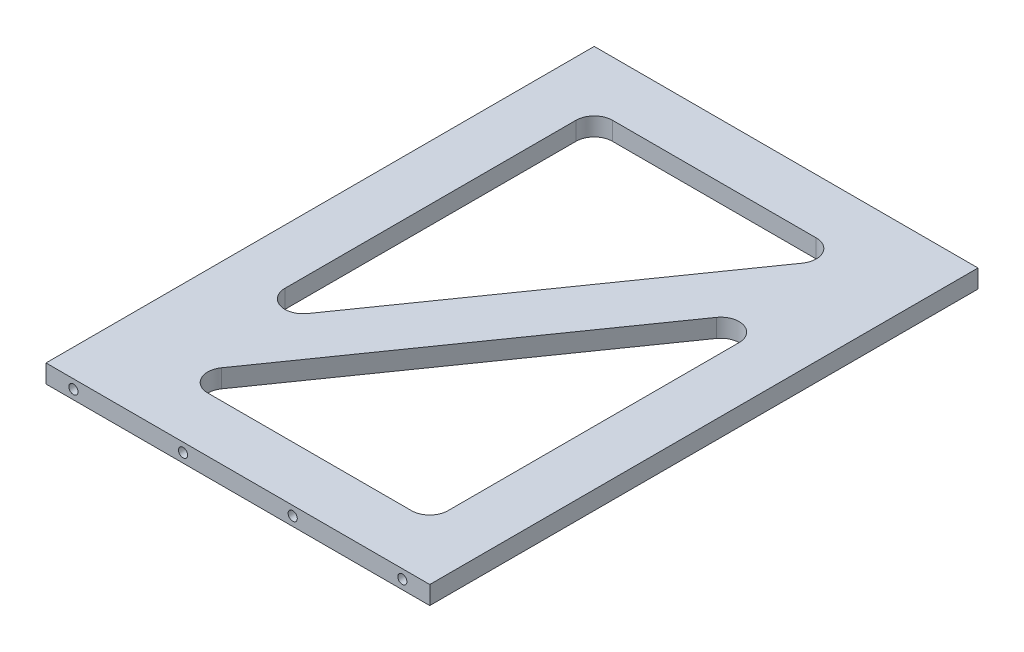
ISO-10303-21;
HEADER;
FILE_DESCRIPTION(('STEP AP214'),'2;1');
FILE_NAME('part.step','',(''),(''),'','','');
FILE_SCHEMA(('AUTOMOTIVE_DESIGN { 1 0 10303 214 1 1 1 1 }'));
ENDSEC;
DATA;
#1=APPLICATION_CONTEXT('core data for automotive mechanical design processes');
#2=APPLICATION_PROTOCOL_DEFINITION('international standard','automotive_design',2000,#1);
#3=PRODUCT_CONTEXT('',#1,'mechanical');
#4=PRODUCT('Part','Part','',(#3));
#5=PRODUCT_RELATED_PRODUCT_CATEGORY('part','',(#4));
#6=PRODUCT_DEFINITION_FORMATION('','',#4);
#7=PRODUCT_DEFINITION_CONTEXT('part definition',#1,'design');
#8=PRODUCT_DEFINITION('design','',#6,#7);
#9=PRODUCT_DEFINITION_SHAPE('','',#8);
#10=(LENGTH_UNIT() NAMED_UNIT(*) SI_UNIT(.MILLI.,.METRE.));
#11=(NAMED_UNIT(*) PLANE_ANGLE_UNIT() SI_UNIT($,.RADIAN.));
#12=(NAMED_UNIT(*) SI_UNIT($,.STERADIAN.) SOLID_ANGLE_UNIT());
#13=UNCERTAINTY_MEASURE_WITH_UNIT(LENGTH_MEASURE(1.E-05),#10,'distance_accuracy_value','');
#14=(GEOMETRIC_REPRESENTATION_CONTEXT(3) GLOBAL_UNCERTAINTY_ASSIGNED_CONTEXT((#13)) GLOBAL_UNIT_ASSIGNED_CONTEXT((#10,
#11,#12)) REPRESENTATION_CONTEXT('',''));
#15=CARTESIAN_POINT('',(0.,0.,0.));
#16=DIRECTION('',(0.,0.,1.));
#17=DIRECTION('',(1.,0.,0.));
#18=AXIS2_PLACEMENT_3D('',#15,#16,#17);
#19=CARTESIAN_POINT('',(0.,10.,0.));
#20=DIRECTION('',(1.,0.,0.));
#21=DIRECTION('',(0.,0.,-1.));
#22=AXIS2_PLACEMENT_3D('',#19,#20,#21);
#23=PLANE('',#22);
#24=DIRECTION('',(0.,0.,1.));
#25=VECTOR('',#24,1.);
#26=CARTESIAN_POINT('',(0.,0.,0.));
#27=LINE('',#26,#25);
#28=CARTESIAN_POINT('',(0.,0.,-300.));
#29=VERTEX_POINT('',#28);
#30=CARTESIAN_POINT('',(0.,0.,0.));
#31=VERTEX_POINT('',#30);
#32=EDGE_CURVE('E263',#29,#31,#27,.T.);
#33=ORIENTED_EDGE('',*,*,#32,.T.);
#34=DIRECTION('',(0.,-1.,0.));
#35=VECTOR('',#34,1.);
#36=CARTESIAN_POINT('',(0.,10.,0.));
#37=LINE('',#36,#35);
#38=CARTESIAN_POINT('',(0.,10.,0.));
#39=VERTEX_POINT('',#38);
#40=EDGE_CURVE('E296',#39,#31,#37,.T.);
#41=ORIENTED_EDGE('',*,*,#40,.F.);
#42=DIRECTION('',(0.,0.,1.));
#43=VECTOR('',#42,1.);
#44=CARTESIAN_POINT('',(0.,10.,0.));
#45=LINE('',#44,#43);
#46=CARTESIAN_POINT('',(0.,10.,-300.));
#47=VERTEX_POINT('',#46);
#48=EDGE_CURVE('E270',#47,#39,#45,.T.);
#49=ORIENTED_EDGE('',*,*,#48,.F.);
#50=DIRECTION('',(0.,-1.,0.));
#51=VECTOR('',#50,1.);
#52=CARTESIAN_POINT('',(0.,10.,-300.));
#53=LINE('',#52,#51);
#54=EDGE_CURVE('E280',#47,#29,#53,.T.);
#55=ORIENTED_EDGE('',*,*,#54,.T.);
#56=EDGE_LOOP('',(#33,#41,#49,#55));
#57=FACE_BOUND('',#56,.T.);
#58=ADVANCED_FACE('F44',(#57),#23,.F.);
#59=CARTESIAN_POINT('',(0.,10.,0.));
#60=DIRECTION('',(0.,0.,-1.));
#61=DIRECTION('',(-1.,0.,0.));
#62=AXIS2_PLACEMENT_3D('',#59,#60,#61);
#63=PLANE('',#62);
#64=CARTESIAN_POINT('',(15.,5.,0.));
#65=DIRECTION('',(0.,0.,1.));
#66=DIRECTION('',(1.,0.,0.));
#67=AXIS2_PLACEMENT_3D('',#64,#65,#66);
#68=CIRCLE('',#67,2.5);
#69=CARTESIAN_POINT('',(17.5,5.,0.));
#70=VERTEX_POINT('',#69);
#71=EDGE_CURVE('E212',#70,#70,#68,.T.);
#72=ORIENTED_EDGE('',*,*,#71,.F.);
#73=EDGE_LOOP('',(#72));
#74=FACE_BOUND('',#73,.T.);
#75=CARTESIAN_POINT('',(135.,5.,0.));
#76=DIRECTION('',(0.,0.,1.));
#77=DIRECTION('',(1.,0.,0.));
#78=AXIS2_PLACEMENT_3D('',#75,#76,#77);
#79=CIRCLE('',#78,2.5);
#80=CARTESIAN_POINT('',(137.5,5.,0.));
#81=VERTEX_POINT('',#80);
#82=EDGE_CURVE('E218',#81,#81,#79,.T.);
#83=ORIENTED_EDGE('',*,*,#82,.F.);
#84=EDGE_LOOP('',(#83));
#85=FACE_BOUND('',#84,.T.);
#86=CARTESIAN_POINT('',(195.,5.,0.));
#87=DIRECTION('',(0.,0.,1.));
#88=DIRECTION('',(1.,0.,0.));
#89=AXIS2_PLACEMENT_3D('',#86,#87,#88);
#90=CIRCLE('',#89,2.5);
#91=CARTESIAN_POINT('',(197.5,5.,0.));
#92=VERTEX_POINT('',#91);
#93=EDGE_CURVE('E224',#92,#92,#90,.T.);
#94=ORIENTED_EDGE('',*,*,#93,.F.);
#95=EDGE_LOOP('',(#94));
#96=FACE_BOUND('',#95,.T.);
#97=CARTESIAN_POINT('',(75.,5.,0.));
#98=DIRECTION('',(0.,0.,1.));
#99=DIRECTION('',(1.,0.,0.));
#100=AXIS2_PLACEMENT_3D('',#97,#98,#99);
#101=CIRCLE('',#100,2.5);
#102=CARTESIAN_POINT('',(77.5,5.,0.));
#103=VERTEX_POINT('',#102);
#104=EDGE_CURVE('E230',#103,#103,#101,.T.);
#105=ORIENTED_EDGE('',*,*,#104,.F.);
#106=EDGE_LOOP('',(#105));
#107=FACE_BOUND('',#106,.T.);
#108=DIRECTION('',(1.,0.,0.));
#109=VECTOR('',#108,1.);
#110=CARTESIAN_POINT('',(0.,0.,0.));
#111=LINE('',#110,#109);
#112=CARTESIAN_POINT('',(210.,0.,0.));
#113=VERTEX_POINT('',#112);
#114=EDGE_CURVE('E283',#31,#113,#111,.T.);
#115=ORIENTED_EDGE('',*,*,#114,.T.);
#116=DIRECTION('',(0.,-1.,0.));
#117=VECTOR('',#116,1.);
#118=CARTESIAN_POINT('',(210.,10.,0.));
#119=LINE('',#118,#117);
#120=CARTESIAN_POINT('',(210.,10.,0.));
#121=VERTEX_POINT('',#120);
#122=EDGE_CURVE('E293',#121,#113,#119,.T.);
#123=ORIENTED_EDGE('',*,*,#122,.F.);
#124=DIRECTION('',(1.,0.,0.));
#125=VECTOR('',#124,1.);
#126=CARTESIAN_POINT('',(0.,10.,0.));
#127=LINE('',#126,#125);
#128=EDGE_CURVE('E273',#39,#121,#127,.T.);
#129=ORIENTED_EDGE('',*,*,#128,.F.);
#130=ORIENTED_EDGE('',*,*,#40,.T.);
#131=EDGE_LOOP('',(#115,#123,#129,#130));
#132=FACE_BOUND('',#131,.T.);
#133=ADVANCED_FACE('F388',(#74,#85,#96,#107,#132),#63,.F.);
#134=CARTESIAN_POINT('',(210.,10.,0.));
#135=DIRECTION('',(-1.,0.,0.));
#136=DIRECTION('',(0.,0.,1.));
#137=AXIS2_PLACEMENT_3D('',#134,#135,#136);
#138=PLANE('',#137);
#139=DIRECTION('',(0.,0.,-1.));
#140=VECTOR('',#139,1.);
#141=CARTESIAN_POINT('',(210.,0.,0.));
#142=LINE('',#141,#140);
#143=CARTESIAN_POINT('',(210.,0.,-300.));
#144=VERTEX_POINT('',#143);
#145=EDGE_CURVE('E285',#113,#144,#142,.T.);
#146=ORIENTED_EDGE('',*,*,#145,.T.);
#147=DIRECTION('',(0.,-1.,0.));
#148=VECTOR('',#147,1.);
#149=CARTESIAN_POINT('',(210.,10.,-300.));
#150=LINE('',#149,#148);
#151=CARTESIAN_POINT('',(210.,10.,-300.));
#152=VERTEX_POINT('',#151);
#153=EDGE_CURVE('E290',#152,#144,#150,.T.);
#154=ORIENTED_EDGE('',*,*,#153,.F.);
#155=DIRECTION('',(0.,0.,-1.));
#156=VECTOR('',#155,1.);
#157=CARTESIAN_POINT('',(210.,10.,0.));
#158=LINE('',#157,#156);
#159=EDGE_CURVE('E276',#121,#152,#158,.T.);
#160=ORIENTED_EDGE('',*,*,#159,.F.);
#161=ORIENTED_EDGE('',*,*,#122,.T.);
#162=EDGE_LOOP('',(#146,#154,#160,#161));
#163=FACE_BOUND('',#162,.T.);
#164=ADVANCED_FACE('F395',(#163),#138,.F.);
#165=CARTESIAN_POINT('',(0.,10.,-300.));
#166=DIRECTION('',(0.,0.,1.));
#167=DIRECTION('',(1.,0.,0.));
#168=AXIS2_PLACEMENT_3D('',#165,#166,#167);
#169=PLANE('',#168);
#170=CARTESIAN_POINT('',(195.,5.,-300.));
#171=DIRECTION('',(0.,0.,-1.));
#172=DIRECTION('',(-1.,0.,0.));
#173=AXIS2_PLACEMENT_3D('',#170,#171,#172);
#174=CIRCLE('',#173,2.5);
#175=CARTESIAN_POINT('',(192.5,5.,-300.));
#176=VERTEX_POINT('',#175);
#177=EDGE_CURVE('E190',#176,#176,#174,.T.);
#178=ORIENTED_EDGE('',*,*,#177,.F.);
#179=EDGE_LOOP('',(#178));
#180=FACE_BOUND('',#179,.T.);
#181=CARTESIAN_POINT('',(15.,5.00000000000003,-300.));
#182=DIRECTION('',(0.,0.,-1.));
#183=DIRECTION('',(-1.,0.,0.));
#184=AXIS2_PLACEMENT_3D('',#181,#182,#183);
#185=CIRCLE('',#184,2.49999999999999);
#186=CARTESIAN_POINT('',(12.5,5.00000000000003,-300.));
#187=VERTEX_POINT('',#186);
#188=EDGE_CURVE('E189',#187,#187,#185,.T.);
#189=ORIENTED_EDGE('',*,*,#188,.F.);
#190=EDGE_LOOP('',(#189));
#191=FACE_BOUND('',#190,.T.);
#192=CARTESIAN_POINT('',(135.,5.,-300.));
#193=DIRECTION('',(0.,0.,-1.));
#194=DIRECTION('',(-1.,0.,0.));
#195=AXIS2_PLACEMENT_3D('',#192,#193,#194);
#196=CIRCLE('',#195,2.5);
#197=CARTESIAN_POINT('',(132.5,5.,-300.));
#198=VERTEX_POINT('',#197);
#199=EDGE_CURVE('E200',#198,#198,#196,.T.);
#200=ORIENTED_EDGE('',*,*,#199,.F.);
#201=EDGE_LOOP('',(#200));
#202=FACE_BOUND('',#201,.T.);
#203=CARTESIAN_POINT('',(75.,5.00000000000003,-300.));
#204=DIRECTION('',(0.,0.,-1.));
#205=DIRECTION('',(-1.,0.,0.));
#206=AXIS2_PLACEMENT_3D('',#203,#204,#205);
#207=CIRCLE('',#206,2.49999999999999);
#208=CARTESIAN_POINT('',(72.5,5.00000000000003,-300.));
#209=VERTEX_POINT('',#208);
#210=EDGE_CURVE('E206',#209,#209,#207,.T.);
#211=ORIENTED_EDGE('',*,*,#210,.F.);
#212=EDGE_LOOP('',(#211));
#213=FACE_BOUND('',#212,.T.);
#214=DIRECTION('',(-1.,0.,0.));
#215=VECTOR('',#214,1.);
#216=CARTESIAN_POINT('',(0.,0.,-300.));
#217=LINE('',#216,#215);
#218=EDGE_CURVE('E274',#144,#29,#217,.T.);
#219=ORIENTED_EDGE('',*,*,#218,.T.);
#220=ORIENTED_EDGE('',*,*,#54,.F.);
#221=DIRECTION('',(-1.,0.,0.));
#222=VECTOR('',#221,1.);
#223=CARTESIAN_POINT('',(0.,10.,-300.));
#224=LINE('',#223,#222);
#225=EDGE_CURVE('E278',#152,#47,#224,.T.);
#226=ORIENTED_EDGE('',*,*,#225,.F.);
#227=ORIENTED_EDGE('',*,*,#153,.T.);
#228=EDGE_LOOP('',(#219,#220,#226,#227));
#229=FACE_BOUND('',#228,.T.);
#230=ADVANCED_FACE('F401',(#180,#191,#202,#213,#229),#169,.F.);
#231=CARTESIAN_POINT('',(0.,10.,0.));
#232=DIRECTION('',(0.,-1.,0.));
#233=DIRECTION('',(0.,0.,-1.));
#234=AXIS2_PLACEMENT_3D('',#231,#232,#233);
#235=PLANE('',#234);
#236=DIRECTION('',(-1.,0.,0.));
#237=VECTOR('',#236,1.);
#238=CARTESIAN_POINT('',(30.,10.,-270.));
#239=LINE('',#238,#237);
#240=CARTESIAN_POINT('',(151.483610960666,10.,-270.));
#241=VERTEX_POINT('',#240);
#242=CARTESIAN_POINT('',(40.,10.,-270.));
#243=VERTEX_POINT('',#242);
#244=EDGE_CURVE('E250',#241,#243,#239,.T.);
#245=ORIENTED_EDGE('',*,*,#244,.F.);
#246=CARTESIAN_POINT('',(151.483610960666,10.,-260.));
#247=DIRECTION('',(0.,-1.,0.));
#248=DIRECTION('',(0.,0.,-1.));
#249=AXIS2_PLACEMENT_3D('',#246,#247,#248);
#250=CIRCLE('',#249,10.);
#251=CARTESIAN_POINT('',(159.675930165856,10.,-254.265376556367));
#252=VERTEX_POINT('',#251);
#253=EDGE_CURVE('E336',#241,#252,#250,.T.);
#254=ORIENTED_EDGE('',*,*,#253,.T.);
#255=DIRECTION('',(0.573462344363328,0.,-0.819231920519041));
#256=VECTOR('',#255,1.);
#257=CARTESIAN_POINT('',(170.690166576399,10.,-270.));
#258=LINE('',#257,#256);
#259=CARTESIAN_POINT('',(48.1923192051904,10.,-95.003075183987));
#260=VERTEX_POINT('',#259);
#261=EDGE_CURVE('E236',#260,#252,#258,.T.);
#262=ORIENTED_EDGE('',*,*,#261,.F.);
#263=CARTESIAN_POINT('',(40.,10.,-100.73769862762));
#264=DIRECTION('',(0.,-1.,0.));
#265=DIRECTION('',(0.,0.,-1.));
#266=AXIS2_PLACEMENT_3D('',#263,#264,#265);
#267=CIRCLE('',#266,10.);
#268=CARTESIAN_POINT('',(30.,10.,-100.73769862762));
#269=VERTEX_POINT('',#268);
#270=EDGE_CURVE('E344',#260,#269,#267,.T.);
#271=ORIENTED_EDGE('',*,*,#270,.T.);
#272=DIRECTION('',(0.,0.,1.));
#273=VECTOR('',#272,1.);
#274=CARTESIAN_POINT('',(30.,10.,-69.0140477480008));
#275=LINE('',#274,#273);
#276=CARTESIAN_POINT('',(30.,10.,-260.));
#277=VERTEX_POINT('',#276);
#278=EDGE_CURVE('E241',#277,#269,#275,.T.);
#279=ORIENTED_EDGE('',*,*,#278,.F.);
#280=CARTESIAN_POINT('',(40.,10.,-260.));
#281=DIRECTION('',(0.,-1.,0.));
#282=DIRECTION('',(0.,0.,-1.));
#283=AXIS2_PLACEMENT_3D('',#280,#281,#282);
#284=CIRCLE('',#283,10.);
#285=EDGE_CURVE('E328',#277,#243,#284,.T.);
#286=ORIENTED_EDGE('',*,*,#285,.T.);
#287=EDGE_LOOP('',(#245,#254,#262,#271,#279,#286));
#288=FACE_BOUND('',#287,.T.);
#289=DIRECTION('',(1.,0.,0.));
#290=VECTOR('',#289,1.);
#291=CARTESIAN_POINT('',(39.3098334236006,10.,-30.));
#292=LINE('',#291,#290);
#293=CARTESIAN_POINT('',(58.5163890393343,10.,-30.));
#294=VERTEX_POINT('',#293);
#295=CARTESIAN_POINT('',(170.,10.,-30.));
#296=VERTEX_POINT('',#295);
#297=EDGE_CURVE('E266',#294,#296,#292,.T.);
#298=ORIENTED_EDGE('',*,*,#297,.F.);
#299=CARTESIAN_POINT('',(58.5163890393343,10.,-40.));
#300=DIRECTION('',(0.,-1.,0.));
#301=DIRECTION('',(0.,0.,-1.));
#302=AXIS2_PLACEMENT_3D('',#299,#300,#301);
#303=CIRCLE('',#302,10.);
#304=CARTESIAN_POINT('',(50.3240698341439,10.,-45.7346234436333));
#305=VERTEX_POINT('',#304);
#306=EDGE_CURVE('E52',#294,#305,#303,.T.);
#307=ORIENTED_EDGE('',*,*,#306,.T.);
#308=DIRECTION('',(-0.573462344363328,0.,0.81923192051904));
#309=VECTOR('',#308,1.);
#310=CARTESIAN_POINT('',(180.,10.,-230.985952251999));
#311=LINE('',#310,#309);
#312=CARTESIAN_POINT('',(161.80768079481,10.,-204.996924816013));
#313=VERTEX_POINT('',#312);
#314=EDGE_CURVE('E247',#313,#305,#311,.T.);
#315=ORIENTED_EDGE('',*,*,#314,.F.);
#316=CARTESIAN_POINT('',(170.,10.,-199.26230137238));
#317=DIRECTION('',(0.,-1.,0.));
#318=DIRECTION('',(0.,0.,-1.));
#319=AXIS2_PLACEMENT_3D('',#316,#317,#318);
#320=CIRCLE('',#319,10.);
#321=CARTESIAN_POINT('',(180.,10.,-199.26230137238));
#322=VERTEX_POINT('',#321);
#323=EDGE_CURVE('E332',#313,#322,#320,.T.);
#324=ORIENTED_EDGE('',*,*,#323,.T.);
#325=DIRECTION('',(0.,0.,-1.));
#326=VECTOR('',#325,1.);
#327=CARTESIAN_POINT('',(180.,10.,-30.));
#328=LINE('',#327,#326);
#329=CARTESIAN_POINT('',(180.,10.,-40.));
#330=VERTEX_POINT('',#329);
#331=EDGE_CURVE('E258',#330,#322,#328,.T.);
#332=ORIENTED_EDGE('',*,*,#331,.F.);
#333=CARTESIAN_POINT('',(170.,10.,-40.));
#334=DIRECTION('',(0.,-1.,0.));
#335=DIRECTION('',(0.,0.,-1.));
#336=AXIS2_PLACEMENT_3D('',#333,#334,#335);
#337=CIRCLE('',#336,10.);
#338=EDGE_CURVE('E340',#330,#296,#337,.T.);
#339=ORIENTED_EDGE('',*,*,#338,.T.);
#340=EDGE_LOOP('',(#298,#307,#315,#324,#332,#339));
#341=FACE_BOUND('',#340,.T.);
#342=ORIENTED_EDGE('',*,*,#48,.T.);
#343=ORIENTED_EDGE('',*,*,#128,.T.);
#344=ORIENTED_EDGE('',*,*,#159,.T.);
#345=ORIENTED_EDGE('',*,*,#225,.T.);
#346=EDGE_LOOP('',(#342,#343,#344,#345));
#347=FACE_BOUND('',#346,.T.);
#348=ADVANCED_FACE('F350',(#288,#341,#347),#235,.F.);
#349=CARTESIAN_POINT('',(0.,0.,0.));
#350=DIRECTION('',(0.,-1.,0.));
#351=DIRECTION('',(0.,0.,-1.));
#352=AXIS2_PLACEMENT_3D('',#349,#350,#351);
#353=PLANE('',#352);
#354=DIRECTION('',(0.,0.,1.));
#355=VECTOR('',#354,1.);
#356=CARTESIAN_POINT('',(30.,0.,-69.0140477480008));
#357=LINE('',#356,#355);
#358=CARTESIAN_POINT('',(30.,0.,-260.));
#359=VERTEX_POINT('',#358);
#360=CARTESIAN_POINT('',(30.,0.,-100.73769862762));
#361=VERTEX_POINT('',#360);
#362=EDGE_CURVE('E244',#359,#361,#357,.T.);
#363=ORIENTED_EDGE('',*,*,#362,.T.);
#364=CARTESIAN_POINT('',(40.,0.,-100.73769862762));
#365=DIRECTION('',(0.,-1.,0.));
#366=DIRECTION('',(0.,0.,-1.));
#367=AXIS2_PLACEMENT_3D('',#364,#365,#366);
#368=CIRCLE('',#367,10.);
#369=CARTESIAN_POINT('',(48.1923192051904,0.,-95.003075183987));
#370=VERTEX_POINT('',#369);
#371=EDGE_CURVE('E346',#361,#370,#368,.F.);
#372=ORIENTED_EDGE('',*,*,#371,.T.);
#373=DIRECTION('',(0.573462344363328,0.,-0.819231920519041));
#374=VECTOR('',#373,1.);
#375=CARTESIAN_POINT('',(170.690166576399,0.,-270.));
#376=LINE('',#375,#374);
#377=CARTESIAN_POINT('',(159.675930165856,0.,-254.265376556367));
#378=VERTEX_POINT('',#377);
#379=EDGE_CURVE('E237',#370,#378,#376,.T.);
#380=ORIENTED_EDGE('',*,*,#379,.T.);
#381=CARTESIAN_POINT('',(151.483610960666,0.,-260.));
#382=DIRECTION('',(0.,-1.,0.));
#383=DIRECTION('',(0.,0.,-1.));
#384=AXIS2_PLACEMENT_3D('',#381,#382,#383);
#385=CIRCLE('',#384,10.);
#386=CARTESIAN_POINT('',(151.483610960666,0.,-270.));
#387=VERTEX_POINT('',#386);
#388=EDGE_CURVE('E338',#378,#387,#385,.F.);
#389=ORIENTED_EDGE('',*,*,#388,.T.);
#390=DIRECTION('',(-1.,0.,0.));
#391=VECTOR('',#390,1.);
#392=CARTESIAN_POINT('',(30.,0.,-270.));
#393=LINE('',#392,#391);
#394=CARTESIAN_POINT('',(40.,0.,-270.));
#395=VERTEX_POINT('',#394);
#396=EDGE_CURVE('E240',#387,#395,#393,.T.);
#397=ORIENTED_EDGE('',*,*,#396,.T.);
#398=CARTESIAN_POINT('',(40.,0.,-260.));
#399=DIRECTION('',(0.,-1.,0.));
#400=DIRECTION('',(0.,0.,-1.));
#401=AXIS2_PLACEMENT_3D('',#398,#399,#400);
#402=CIRCLE('',#401,10.);
#403=EDGE_CURVE('E330',#395,#359,#402,.F.);
#404=ORIENTED_EDGE('',*,*,#403,.T.);
#405=EDGE_LOOP('',(#363,#372,#380,#389,#397,#404));
#406=FACE_BOUND('',#405,.T.);
#407=DIRECTION('',(0.,0.,-1.));
#408=VECTOR('',#407,1.);
#409=CARTESIAN_POINT('',(180.,0.,-30.));
#410=LINE('',#409,#408);
#411=CARTESIAN_POINT('',(180.,0.,-40.));
#412=VERTEX_POINT('',#411);
#413=CARTESIAN_POINT('',(180.,0.,-199.26230137238));
#414=VERTEX_POINT('',#413);
#415=EDGE_CURVE('E260',#412,#414,#410,.T.);
#416=ORIENTED_EDGE('',*,*,#415,.T.);
#417=CARTESIAN_POINT('',(170.,0.,-199.26230137238));
#418=DIRECTION('',(0.,-1.,0.));
#419=DIRECTION('',(0.,0.,-1.));
#420=AXIS2_PLACEMENT_3D('',#417,#418,#419);
#421=CIRCLE('',#420,10.);
#422=CARTESIAN_POINT('',(161.80768079481,0.,-204.996924816013));
#423=VERTEX_POINT('',#422);
#424=EDGE_CURVE('E334',#414,#423,#421,.F.);
#425=ORIENTED_EDGE('',*,*,#424,.T.);
#426=DIRECTION('',(-0.573462344363328,0.,0.81923192051904));
#427=VECTOR('',#426,1.);
#428=CARTESIAN_POINT('',(180.,0.,-230.985952251999));
#429=LINE('',#428,#427);
#430=CARTESIAN_POINT('',(50.3240698341439,0.,-45.7346234436333));
#431=VERTEX_POINT('',#430);
#432=EDGE_CURVE('E255',#423,#431,#429,.T.);
#433=ORIENTED_EDGE('',*,*,#432,.T.);
#434=CARTESIAN_POINT('',(58.5163890393343,0.,-40.));
#435=DIRECTION('',(0.,-1.,0.));
#436=DIRECTION('',(0.,0.,-1.));
#437=AXIS2_PLACEMENT_3D('',#434,#435,#436);
#438=CIRCLE('',#437,10.);
#439=CARTESIAN_POINT('',(58.5163890393343,0.,-30.));
#440=VERTEX_POINT('',#439);
#441=EDGE_CURVE('E11',#431,#440,#438,.F.);
#442=ORIENTED_EDGE('',*,*,#441,.T.);
#443=DIRECTION('',(1.,0.,0.));
#444=VECTOR('',#443,1.);
#445=CARTESIAN_POINT('',(39.3098334236006,0.,-30.));
#446=LINE('',#445,#444);
#447=CARTESIAN_POINT('',(170.,0.,-30.));
#448=VERTEX_POINT('',#447);
#449=EDGE_CURVE('E257',#440,#448,#446,.T.);
#450=ORIENTED_EDGE('',*,*,#449,.T.);
#451=CARTESIAN_POINT('',(170.,0.,-40.));
#452=DIRECTION('',(0.,-1.,0.));
#453=DIRECTION('',(0.,0.,-1.));
#454=AXIS2_PLACEMENT_3D('',#451,#452,#453);
#455=CIRCLE('',#454,10.);
#456=EDGE_CURVE('E342',#448,#412,#455,.F.);
#457=ORIENTED_EDGE('',*,*,#456,.T.);
#458=EDGE_LOOP('',(#416,#425,#433,#442,#450,#457));
#459=FACE_BOUND('',#458,.T.);
#460=ORIENTED_EDGE('',*,*,#32,.F.);
#461=ORIENTED_EDGE('',*,*,#218,.F.);
#462=ORIENTED_EDGE('',*,*,#145,.F.);
#463=ORIENTED_EDGE('',*,*,#114,.F.);
#464=EDGE_LOOP('',(#460,#461,#462,#463));
#465=FACE_BOUND('',#464,.T.);
#466=ADVANCED_FACE('F361',(#406,#459,#465),#353,.T.);
#467=CARTESIAN_POINT('',(180.,0.,-230.985952251999));
#468=DIRECTION('',(-0.819231920519041,0.,-0.573462344363328));
#469=DIRECTION('',(-0.573462344363328,0.,0.819231920519041));
#470=AXIS2_PLACEMENT_3D('',#467,#468,#469);
#471=PLANE('',#470);
#472=ORIENTED_EDGE('',*,*,#432,.F.);
#473=DIRECTION('',(0.,1.,0.));
#474=VECTOR('',#473,1.);
#475=CARTESIAN_POINT('',(161.80768079481,10.,-204.996924816013));
#476=LINE('',#475,#474);
#477=EDGE_CURVE('E311',#423,#313,#476,.T.);
#478=ORIENTED_EDGE('',*,*,#477,.T.);
#479=ORIENTED_EDGE('',*,*,#314,.T.);
#480=DIRECTION('',(0.,1.,0.));
#481=VECTOR('',#480,1.);
#482=CARTESIAN_POINT('',(50.3240698341439,0.,-45.7346234436333));
#483=LINE('',#482,#481);
#484=EDGE_CURVE('E309',#305,#431,#483,.F.);
#485=ORIENTED_EDGE('',*,*,#484,.T.);
#486=EDGE_LOOP('',(#472,#478,#479,#485));
#487=FACE_BOUND('',#486,.T.);
#488=ADVANCED_FACE('F357',(#487),#471,.F.);
#489=CARTESIAN_POINT('',(180.,0.,-30.));
#490=DIRECTION('',(1.,0.,0.));
#491=DIRECTION('',(0.,0.,-1.));
#492=AXIS2_PLACEMENT_3D('',#489,#490,#491);
#493=PLANE('',#492);
#494=ORIENTED_EDGE('',*,*,#331,.T.);
#495=DIRECTION('',(0.,1.,0.));
#496=VECTOR('',#495,1.);
#497=CARTESIAN_POINT('',(180.,0.,-199.26230137238));
#498=LINE('',#497,#496);
#499=EDGE_CURVE('E317',#322,#414,#498,.F.);
#500=ORIENTED_EDGE('',*,*,#499,.T.);
#501=ORIENTED_EDGE('',*,*,#415,.F.);
#502=DIRECTION('',(0.,1.,0.));
#503=VECTOR('',#502,1.);
#504=CARTESIAN_POINT('',(180.,10.,-40.));
#505=LINE('',#504,#503);
#506=EDGE_CURVE('E314',#412,#330,#505,.T.);
#507=ORIENTED_EDGE('',*,*,#506,.T.);
#508=EDGE_LOOP('',(#494,#500,#501,#507));
#509=FACE_BOUND('',#508,.T.);
#510=ADVANCED_FACE('F369',(#509),#493,.F.);
#511=CARTESIAN_POINT('',(39.3098334236006,0.,-30.));
#512=DIRECTION('',(0.,0.,1.));
#513=DIRECTION('',(1.,0.,0.));
#514=AXIS2_PLACEMENT_3D('',#511,#512,#513);
#515=PLANE('',#514);
#516=ORIENTED_EDGE('',*,*,#297,.T.);
#517=DIRECTION('',(0.,1.,0.));
#518=VECTOR('',#517,1.);
#519=CARTESIAN_POINT('',(170.,0.,-30.));
#520=LINE('',#519,#518);
#521=EDGE_CURVE('E59',#296,#448,#520,.F.);
#522=ORIENTED_EDGE('',*,*,#521,.T.);
#523=ORIENTED_EDGE('',*,*,#449,.F.);
#524=DIRECTION('',(0.,1.,0.));
#525=VECTOR('',#524,1.);
#526=CARTESIAN_POINT('',(58.5163890393343,10.,-30.));
#527=LINE('',#526,#525);
#528=EDGE_CURVE('E324',#440,#294,#527,.T.);
#529=ORIENTED_EDGE('',*,*,#528,.T.);
#530=EDGE_LOOP('',(#516,#522,#523,#529));
#531=FACE_BOUND('',#530,.T.);
#532=ADVANCED_FACE('F359',(#531),#515,.F.);
#533=CARTESIAN_POINT('',(170.690166576399,0.,-270.));
#534=DIRECTION('',(0.819231920519041,0.,0.573462344363328));
#535=DIRECTION('',(0.573462344363328,0.,-0.819231920519041));
#536=AXIS2_PLACEMENT_3D('',#533,#534,#535);
#537=PLANE('',#536);
#538=ORIENTED_EDGE('',*,*,#261,.T.);
#539=DIRECTION('',(0.,1.,0.));
#540=VECTOR('',#539,1.);
#541=CARTESIAN_POINT('',(159.675930165856,0.,-254.265376556367));
#542=LINE('',#541,#540);
#543=EDGE_CURVE('E322',#252,#378,#542,.F.);
#544=ORIENTED_EDGE('',*,*,#543,.T.);
#545=ORIENTED_EDGE('',*,*,#379,.F.);
#546=DIRECTION('',(0.,1.,0.));
#547=VECTOR('',#546,1.);
#548=CARTESIAN_POINT('',(48.1923192051904,10.,-95.0030751839871));
#549=LINE('',#548,#547);
#550=EDGE_CURVE('E319',#370,#260,#549,.T.);
#551=ORIENTED_EDGE('',*,*,#550,.T.);
#552=EDGE_LOOP('',(#538,#544,#545,#551));
#553=FACE_BOUND('',#552,.T.);
#554=ADVANCED_FACE('F416',(#553),#537,.F.);
#555=CARTESIAN_POINT('',(30.,0.,-69.0140477480008));
#556=DIRECTION('',(-1.,0.,0.));
#557=DIRECTION('',(0.,0.,1.));
#558=AXIS2_PLACEMENT_3D('',#555,#556,#557);
#559=PLANE('',#558);
#560=ORIENTED_EDGE('',*,*,#362,.F.);
#561=DIRECTION('',(0.,1.,0.));
#562=VECTOR('',#561,1.);
#563=CARTESIAN_POINT('',(30.,10.,-260.));
#564=LINE('',#563,#562);
#565=EDGE_CURVE('E301',#359,#277,#564,.T.);
#566=ORIENTED_EDGE('',*,*,#565,.T.);
#567=ORIENTED_EDGE('',*,*,#278,.T.);
#568=DIRECTION('',(0.,1.,0.));
#569=VECTOR('',#568,1.);
#570=CARTESIAN_POINT('',(30.,0.,-100.73769862762));
#571=LINE('',#570,#569);
#572=EDGE_CURVE('E299',#269,#361,#571,.F.);
#573=ORIENTED_EDGE('',*,*,#572,.T.);
#574=EDGE_LOOP('',(#560,#566,#567,#573));
#575=FACE_BOUND('',#574,.T.);
#576=ADVANCED_FACE('F421',(#575),#559,.F.);
#577=CARTESIAN_POINT('',(30.,0.,-270.));
#578=DIRECTION('',(0.,0.,-1.));
#579=DIRECTION('',(-1.,0.,0.));
#580=AXIS2_PLACEMENT_3D('',#577,#578,#579);
#581=PLANE('',#580);
#582=ORIENTED_EDGE('',*,*,#244,.T.);
#583=DIRECTION('',(0.,1.,0.));
#584=VECTOR('',#583,1.);
#585=CARTESIAN_POINT('',(40.,0.,-270.));
#586=LINE('',#585,#584);
#587=EDGE_CURVE('E307',#243,#395,#586,.F.);
#588=ORIENTED_EDGE('',*,*,#587,.T.);
#589=ORIENTED_EDGE('',*,*,#396,.F.);
#590=DIRECTION('',(0.,1.,0.));
#591=VECTOR('',#590,1.);
#592=CARTESIAN_POINT('',(151.483610960666,10.,-270.));
#593=LINE('',#592,#591);
#594=EDGE_CURVE('E304',#387,#241,#593,.T.);
#595=ORIENTED_EDGE('',*,*,#594,.T.);
#596=EDGE_LOOP('',(#582,#588,#589,#595));
#597=FACE_BOUND('',#596,.T.);
#598=ADVANCED_FACE('F384',(#597),#581,.F.);
#599=CARTESIAN_POINT('',(40.,0.,-260.));
#600=DIRECTION('',(0.,-1.,0.));
#601=DIRECTION('',(0.,0.,-1.));
#602=AXIS2_PLACEMENT_3D('',#599,#600,#601);
#603=CYLINDRICAL_SURFACE('',#602,10.);
#604=ORIENTED_EDGE('',*,*,#403,.F.);
#605=ORIENTED_EDGE('',*,*,#587,.F.);
#606=ORIENTED_EDGE('',*,*,#285,.F.);
#607=ORIENTED_EDGE('',*,*,#565,.F.);
#608=EDGE_LOOP('',(#604,#605,#606,#607));
#609=FACE_BOUND('',#608,.T.);
#610=ADVANCED_FACE('F376',(#609),#603,.F.);
#611=CARTESIAN_POINT('',(170.,0.,-199.26230137238));
#612=DIRECTION('',(0.,-1.,0.));
#613=DIRECTION('',(0.,0.,-1.));
#614=AXIS2_PLACEMENT_3D('',#611,#612,#613);
#615=CYLINDRICAL_SURFACE('',#614,10.);
#616=ORIENTED_EDGE('',*,*,#424,.F.);
#617=ORIENTED_EDGE('',*,*,#499,.F.);
#618=ORIENTED_EDGE('',*,*,#323,.F.);
#619=ORIENTED_EDGE('',*,*,#477,.F.);
#620=EDGE_LOOP('',(#616,#617,#618,#619));
#621=FACE_BOUND('',#620,.T.);
#622=ADVANCED_FACE('F373',(#621),#615,.F.);
#623=CARTESIAN_POINT('',(151.483610960666,0.,-260.));
#624=DIRECTION('',(0.,-1.,0.));
#625=DIRECTION('',(0.,0.,-1.));
#626=AXIS2_PLACEMENT_3D('',#623,#624,#625);
#627=CYLINDRICAL_SURFACE('',#626,10.);
#628=ORIENTED_EDGE('',*,*,#388,.F.);
#629=ORIENTED_EDGE('',*,*,#543,.F.);
#630=ORIENTED_EDGE('',*,*,#253,.F.);
#631=ORIENTED_EDGE('',*,*,#594,.F.);
#632=EDGE_LOOP('',(#628,#629,#630,#631));
#633=FACE_BOUND('',#632,.T.);
#634=ADVANCED_FACE('F375',(#633),#627,.F.);
#635=CARTESIAN_POINT('',(170.,0.,-40.));
#636=DIRECTION('',(0.,-1.,0.));
#637=DIRECTION('',(0.,0.,-1.));
#638=AXIS2_PLACEMENT_3D('',#635,#636,#637);
#639=CYLINDRICAL_SURFACE('',#638,10.);
#640=ORIENTED_EDGE('',*,*,#456,.F.);
#641=ORIENTED_EDGE('',*,*,#521,.F.);
#642=ORIENTED_EDGE('',*,*,#338,.F.);
#643=ORIENTED_EDGE('',*,*,#506,.F.);
#644=EDGE_LOOP('',(#640,#641,#642,#643));
#645=FACE_BOUND('',#644,.T.);
#646=ADVANCED_FACE('F366',(#645),#639,.F.);
#647=CARTESIAN_POINT('',(40.,0.,-100.73769862762));
#648=DIRECTION('',(0.,-1.,0.));
#649=DIRECTION('',(0.,0.,-1.));
#650=AXIS2_PLACEMENT_3D('',#647,#648,#649);
#651=CYLINDRICAL_SURFACE('',#650,10.);
#652=ORIENTED_EDGE('',*,*,#371,.F.);
#653=ORIENTED_EDGE('',*,*,#572,.F.);
#654=ORIENTED_EDGE('',*,*,#270,.F.);
#655=ORIENTED_EDGE('',*,*,#550,.F.);
#656=EDGE_LOOP('',(#652,#653,#654,#655));
#657=FACE_BOUND('',#656,.T.);
#658=ADVANCED_FACE('F577',(#657),#651,.F.);
#659=CARTESIAN_POINT('',(58.5163890393343,0.,-40.));
#660=DIRECTION('',(0.,-1.,0.));
#661=DIRECTION('',(0.,0.,-1.));
#662=AXIS2_PLACEMENT_3D('',#659,#660,#661);
#663=CYLINDRICAL_SURFACE('',#662,10.);
#664=ORIENTED_EDGE('',*,*,#441,.F.);
#665=ORIENTED_EDGE('',*,*,#484,.F.);
#666=ORIENTED_EDGE('',*,*,#306,.F.);
#667=ORIENTED_EDGE('',*,*,#528,.F.);
#668=EDGE_LOOP('',(#664,#665,#666,#667));
#669=FACE_BOUND('',#668,.T.);
#670=ADVANCED_FACE('F46',(#669),#663,.F.);
#671=CARTESIAN_POINT('',(75.,5.,-23.));
#672=DIRECTION('',(0.,0.,1.));
#673=DIRECTION('',(1.,0.,0.));
#674=AXIS2_PLACEMENT_3D('',#671,#672,#673);
#675=CONICAL_SURFACE('',#674,2.5,1.02974425867665);
#676=CARTESIAN_POINT('',(75.,5.,-24.5021515475689));
#677=VERTEX_POINT('',#676);
#678=VERTEX_LOOP('',#677);
#679=FACE_BOUND('',#678,.T.);
#680=CARTESIAN_POINT('',(75.,5.,-23.));
#681=DIRECTION('',(0.,0.,1.));
#682=DIRECTION('',(1.,0.,0.));
#683=AXIS2_PLACEMENT_3D('',#680,#681,#682);
#684=CIRCLE('',#683,2.5);
#685=CARTESIAN_POINT('',(77.5,5.,-23.));
#686=VERTEX_POINT('',#685);
#687=EDGE_CURVE('E233',#686,#686,#684,.T.);
#688=ORIENTED_EDGE('',*,*,#687,.T.);
#689=EDGE_LOOP('',(#688));
#690=FACE_BOUND('',#689,.T.);
#691=ADVANCED_FACE('F429',(#679,#690),#675,.F.);
#692=CARTESIAN_POINT('',(75.,5.,0.));
#693=DIRECTION('',(0.,0.,1.));
#694=DIRECTION('',(1.,0.,0.));
#695=AXIS2_PLACEMENT_3D('',#692,#693,#694);
#696=CYLINDRICAL_SURFACE('',#695,2.5);
#697=ORIENTED_EDGE('',*,*,#687,.F.);
#698=EDGE_LOOP('',(#697));
#699=FACE_BOUND('',#698,.T.);
#700=ORIENTED_EDGE('',*,*,#104,.T.);
#701=EDGE_LOOP('',(#700));
#702=FACE_BOUND('',#701,.T.);
#703=ADVANCED_FACE('F432',(#699,#702),#696,.F.);
#704=CARTESIAN_POINT('',(195.,5.,-23.));
#705=DIRECTION('',(0.,0.,1.));
#706=DIRECTION('',(1.,0.,0.));
#707=AXIS2_PLACEMENT_3D('',#704,#705,#706);
#708=CONICAL_SURFACE('',#707,2.5,1.02974425867665);
#709=CARTESIAN_POINT('',(195.,5.,-24.5021515475689));
#710=VERTEX_POINT('',#709);
#711=VERTEX_LOOP('',#710);
#712=FACE_BOUND('',#711,.T.);
#713=CARTESIAN_POINT('',(195.,5.,-23.));
#714=DIRECTION('',(0.,0.,1.));
#715=DIRECTION('',(1.,0.,0.));
#716=AXIS2_PLACEMENT_3D('',#713,#714,#715);
#717=CIRCLE('',#716,2.5);
#718=CARTESIAN_POINT('',(197.5,5.,-23.));
#719=VERTEX_POINT('',#718);
#720=EDGE_CURVE('E227',#719,#719,#717,.T.);
#721=ORIENTED_EDGE('',*,*,#720,.T.);
#722=EDGE_LOOP('',(#721));
#723=FACE_BOUND('',#722,.T.);
#724=ADVANCED_FACE('F436',(#712,#723),#708,.F.);
#725=CARTESIAN_POINT('',(195.,5.,0.));
#726=DIRECTION('',(0.,0.,1.));
#727=DIRECTION('',(1.,0.,0.));
#728=AXIS2_PLACEMENT_3D('',#725,#726,#727);
#729=CYLINDRICAL_SURFACE('',#728,2.5);
#730=ORIENTED_EDGE('',*,*,#720,.F.);
#731=EDGE_LOOP('',(#730));
#732=FACE_BOUND('',#731,.T.);
#733=ORIENTED_EDGE('',*,*,#93,.T.);
#734=EDGE_LOOP('',(#733));
#735=FACE_BOUND('',#734,.T.);
#736=ADVANCED_FACE('F440',(#732,#735),#729,.F.);
#737=CARTESIAN_POINT('',(135.,5.,-23.));
#738=DIRECTION('',(0.,0.,1.));
#739=DIRECTION('',(1.,0.,0.));
#740=AXIS2_PLACEMENT_3D('',#737,#738,#739);
#741=CONICAL_SURFACE('',#740,2.5,1.02974425867665);
#742=CARTESIAN_POINT('',(135.,5.,-24.5021515475689));
#743=VERTEX_POINT('',#742);
#744=VERTEX_LOOP('',#743);
#745=FACE_BOUND('',#744,.T.);
#746=CARTESIAN_POINT('',(135.,5.,-23.));
#747=DIRECTION('',(0.,0.,1.));
#748=DIRECTION('',(1.,0.,0.));
#749=AXIS2_PLACEMENT_3D('',#746,#747,#748);
#750=CIRCLE('',#749,2.5);
#751=CARTESIAN_POINT('',(137.5,5.,-23.));
#752=VERTEX_POINT('',#751);
#753=EDGE_CURVE('E221',#752,#752,#750,.T.);
#754=ORIENTED_EDGE('',*,*,#753,.T.);
#755=EDGE_LOOP('',(#754));
#756=FACE_BOUND('',#755,.T.);
#757=ADVANCED_FACE('F444',(#745,#756),#741,.F.);
#758=CARTESIAN_POINT('',(135.,5.,0.));
#759=DIRECTION('',(0.,0.,1.));
#760=DIRECTION('',(1.,0.,0.));
#761=AXIS2_PLACEMENT_3D('',#758,#759,#760);
#762=CYLINDRICAL_SURFACE('',#761,2.5);
#763=ORIENTED_EDGE('',*,*,#753,.F.);
#764=EDGE_LOOP('',(#763));
#765=FACE_BOUND('',#764,.T.);
#766=ORIENTED_EDGE('',*,*,#82,.T.);
#767=EDGE_LOOP('',(#766));
#768=FACE_BOUND('',#767,.T.);
#769=ADVANCED_FACE('F448',(#765,#768),#762,.F.);
#770=CARTESIAN_POINT('',(15.,5.,-23.));
#771=DIRECTION('',(0.,0.,1.));
#772=DIRECTION('',(1.,0.,0.));
#773=AXIS2_PLACEMENT_3D('',#770,#771,#772);
#774=CONICAL_SURFACE('',#773,2.5,1.02974425867665);
#775=CARTESIAN_POINT('',(15.,5.,-24.5021515475689));
#776=VERTEX_POINT('',#775);
#777=VERTEX_LOOP('',#776);
#778=FACE_BOUND('',#777,.T.);
#779=CARTESIAN_POINT('',(15.,5.,-23.));
#780=DIRECTION('',(0.,0.,1.));
#781=DIRECTION('',(1.,0.,0.));
#782=AXIS2_PLACEMENT_3D('',#779,#780,#781);
#783=CIRCLE('',#782,2.5);
#784=CARTESIAN_POINT('',(17.5,5.,-23.));
#785=VERTEX_POINT('',#784);
#786=EDGE_CURVE('E215',#785,#785,#783,.T.);
#787=ORIENTED_EDGE('',*,*,#786,.T.);
#788=EDGE_LOOP('',(#787));
#789=FACE_BOUND('',#788,.T.);
#790=ADVANCED_FACE('F452',(#778,#789),#774,.F.);
#791=CARTESIAN_POINT('',(15.,5.,0.));
#792=DIRECTION('',(0.,0.,1.));
#793=DIRECTION('',(1.,0.,0.));
#794=AXIS2_PLACEMENT_3D('',#791,#792,#793);
#795=CYLINDRICAL_SURFACE('',#794,2.5);
#796=ORIENTED_EDGE('',*,*,#786,.F.);
#797=EDGE_LOOP('',(#796));
#798=FACE_BOUND('',#797,.T.);
#799=ORIENTED_EDGE('',*,*,#71,.T.);
#800=EDGE_LOOP('',(#799));
#801=FACE_BOUND('',#800,.T.);
#802=ADVANCED_FACE('F456',(#798,#801),#795,.F.);
#803=CARTESIAN_POINT('',(75.,5.00000000000003,-280.));
#804=DIRECTION('',(0.,0.,-1.));
#805=DIRECTION('',(-1.,0.,0.));
#806=AXIS2_PLACEMENT_3D('',#803,#804,#805);
#807=CONICAL_SURFACE('',#806,2.5,1.02974425867666);
#808=CARTESIAN_POINT('',(75.,5.00000000000003,-278.497848452431));
#809=VERTEX_POINT('',#808);
#810=VERTEX_LOOP('',#809);
#811=FACE_BOUND('',#810,.T.);
#812=CARTESIAN_POINT('',(75.,5.00000000000003,-280.));
#813=DIRECTION('',(0.,0.,-1.));
#814=DIRECTION('',(-1.,0.,0.));
#815=AXIS2_PLACEMENT_3D('',#812,#813,#814);
#816=CIRCLE('',#815,2.5);
#817=CARTESIAN_POINT('',(72.5,5.00000000000003,-280.));
#818=VERTEX_POINT('',#817);
#819=EDGE_CURVE('E209',#818,#818,#816,.T.);
#820=ORIENTED_EDGE('',*,*,#819,.T.);
#821=EDGE_LOOP('',(#820));
#822=FACE_BOUND('',#821,.T.);
#823=ADVANCED_FACE('F460',(#811,#822),#807,.F.);
#824=CARTESIAN_POINT('',(75.,5.00000000000003,-300.));
#825=DIRECTION('',(0.,0.,-1.));
#826=DIRECTION('',(-1.,0.,0.));
#827=AXIS2_PLACEMENT_3D('',#824,#825,#826);
#828=CYLINDRICAL_SURFACE('',#827,2.5);
#829=ORIENTED_EDGE('',*,*,#819,.F.);
#830=EDGE_LOOP('',(#829));
#831=FACE_BOUND('',#830,.T.);
#832=ORIENTED_EDGE('',*,*,#210,.T.);
#833=EDGE_LOOP('',(#832));
#834=FACE_BOUND('',#833,.T.);
#835=ADVANCED_FACE('F464',(#831,#834),#828,.F.);
#836=CARTESIAN_POINT('',(135.,5.,-280.));
#837=DIRECTION('',(0.,0.,-1.));
#838=DIRECTION('',(-1.,0.,0.));
#839=AXIS2_PLACEMENT_3D('',#836,#837,#838);
#840=CONICAL_SURFACE('',#839,2.5,1.02974425867666);
#841=CARTESIAN_POINT('',(135.,5.,-278.497848452431));
#842=VERTEX_POINT('',#841);
#843=VERTEX_LOOP('',#842);
#844=FACE_BOUND('',#843,.T.);
#845=CARTESIAN_POINT('',(135.,5.,-280.));
#846=DIRECTION('',(0.,0.,-1.));
#847=DIRECTION('',(-1.,0.,0.));
#848=AXIS2_PLACEMENT_3D('',#845,#846,#847);
#849=CIRCLE('',#848,2.5);
#850=CARTESIAN_POINT('',(132.5,5.,-280.));
#851=VERTEX_POINT('',#850);
#852=EDGE_CURVE('E203',#851,#851,#849,.T.);
#853=ORIENTED_EDGE('',*,*,#852,.T.);
#854=EDGE_LOOP('',(#853));
#855=FACE_BOUND('',#854,.T.);
#856=ADVANCED_FACE('F468',(#844,#855),#840,.F.);
#857=CARTESIAN_POINT('',(135.,5.,-300.));
#858=DIRECTION('',(0.,0.,-1.));
#859=DIRECTION('',(-1.,0.,0.));
#860=AXIS2_PLACEMENT_3D('',#857,#858,#859);
#861=CYLINDRICAL_SURFACE('',#860,2.5);
#862=ORIENTED_EDGE('',*,*,#852,.F.);
#863=EDGE_LOOP('',(#862));
#864=FACE_BOUND('',#863,.T.);
#865=ORIENTED_EDGE('',*,*,#199,.T.);
#866=EDGE_LOOP('',(#865));
#867=FACE_BOUND('',#866,.T.);
#868=ADVANCED_FACE('F472',(#864,#867),#861,.F.);
#869=CARTESIAN_POINT('',(15.,5.00000000000003,-280.));
#870=DIRECTION('',(0.,0.,-1.));
#871=DIRECTION('',(-1.,0.,0.));
#872=AXIS2_PLACEMENT_3D('',#869,#870,#871);
#873=CONICAL_SURFACE('',#872,2.5,1.02974425867666);
#874=CARTESIAN_POINT('',(15.,5.00000000000003,-278.497848452431));
#875=VERTEX_POINT('',#874);
#876=VERTEX_LOOP('',#875);
#877=FACE_BOUND('',#876,.T.);
#878=CARTESIAN_POINT('',(15.,5.00000000000003,-280.));
#879=DIRECTION('',(0.,0.,-1.));
#880=DIRECTION('',(-1.,0.,0.));
#881=AXIS2_PLACEMENT_3D('',#878,#879,#880);
#882=CIRCLE('',#881,2.5);
#883=CARTESIAN_POINT('',(12.5,5.00000000000003,-280.));
#884=VERTEX_POINT('',#883);
#885=EDGE_CURVE('E193',#884,#884,#882,.T.);
#886=ORIENTED_EDGE('',*,*,#885,.T.);
#887=EDGE_LOOP('',(#886));
#888=FACE_BOUND('',#887,.T.);
#889=ADVANCED_FACE('F476',(#877,#888),#873,.F.);
#890=CARTESIAN_POINT('',(15.,5.00000000000003,-300.));
#891=DIRECTION('',(0.,0.,-1.));
#892=DIRECTION('',(-1.,0.,0.));
#893=AXIS2_PLACEMENT_3D('',#890,#891,#892);
#894=CYLINDRICAL_SURFACE('',#893,2.49999999999999);
#895=ORIENTED_EDGE('',*,*,#885,.F.);
#896=EDGE_LOOP('',(#895));
#897=FACE_BOUND('',#896,.T.);
#898=ORIENTED_EDGE('',*,*,#188,.T.);
#899=EDGE_LOOP('',(#898));
#900=FACE_BOUND('',#899,.T.);
#901=ADVANCED_FACE('F183',(#897,#900),#894,.F.);
#902=CARTESIAN_POINT('',(195.,5.,-280.));
#903=DIRECTION('',(0.,0.,-1.));
#904=DIRECTION('',(-1.,0.,0.));
#905=AXIS2_PLACEMENT_3D('',#902,#903,#904);
#906=CONICAL_SURFACE('',#905,2.5,1.02974425867666);
#907=CARTESIAN_POINT('',(195.,5.,-278.497848452431));
#908=VERTEX_POINT('',#907);
#909=VERTEX_LOOP('',#908);
#910=FACE_BOUND('',#909,.T.);
#911=CARTESIAN_POINT('',(195.,5.,-280.));
#912=DIRECTION('',(0.,0.,-1.));
#913=DIRECTION('',(-1.,0.,0.));
#914=AXIS2_PLACEMENT_3D('',#911,#912,#913);
#915=CIRCLE('',#914,2.5);
#916=CARTESIAN_POINT('',(192.5,5.,-280.));
#917=VERTEX_POINT('',#916);
#918=EDGE_CURVE('E187',#917,#917,#915,.T.);
#919=ORIENTED_EDGE('',*,*,#918,.T.);
#920=EDGE_LOOP('',(#919));
#921=FACE_BOUND('',#920,.T.);
#922=ADVANCED_FACE('F179',(#910,#921),#906,.F.);
#923=CARTESIAN_POINT('',(195.,5.,-300.));
#924=DIRECTION('',(0.,0.,-1.));
#925=DIRECTION('',(-1.,0.,0.));
#926=AXIS2_PLACEMENT_3D('',#923,#924,#925);
#927=CYLINDRICAL_SURFACE('',#926,2.5);
#928=ORIENTED_EDGE('',*,*,#918,.F.);
#929=EDGE_LOOP('',(#928));
#930=FACE_BOUND('',#929,.T.);
#931=ORIENTED_EDGE('',*,*,#177,.T.);
#932=EDGE_LOOP('',(#931));
#933=FACE_BOUND('',#932,.T.);
#934=ADVANCED_FACE('F182',(#930,#933),#927,.F.);
#935=CLOSED_SHELL('',(#58,#133,#164,#230,#348,#466,#488,#510,#532,#554,#576,#598,#610,#622,#634,
#646,#658,#670,#691,#703,#724,#736,#757,#769,#790,#802,#823,#835,#856,#868,#889,#901,#922,#934));
#936=MANIFOLD_SOLID_BREP('B2',#935);
#937=ADVANCED_BREP_SHAPE_REPRESENTATION('',(#18,#936),#14);
#938=SHAPE_DEFINITION_REPRESENTATION(#9,#937);
ENDSEC;
END-ISO-10303-21;
